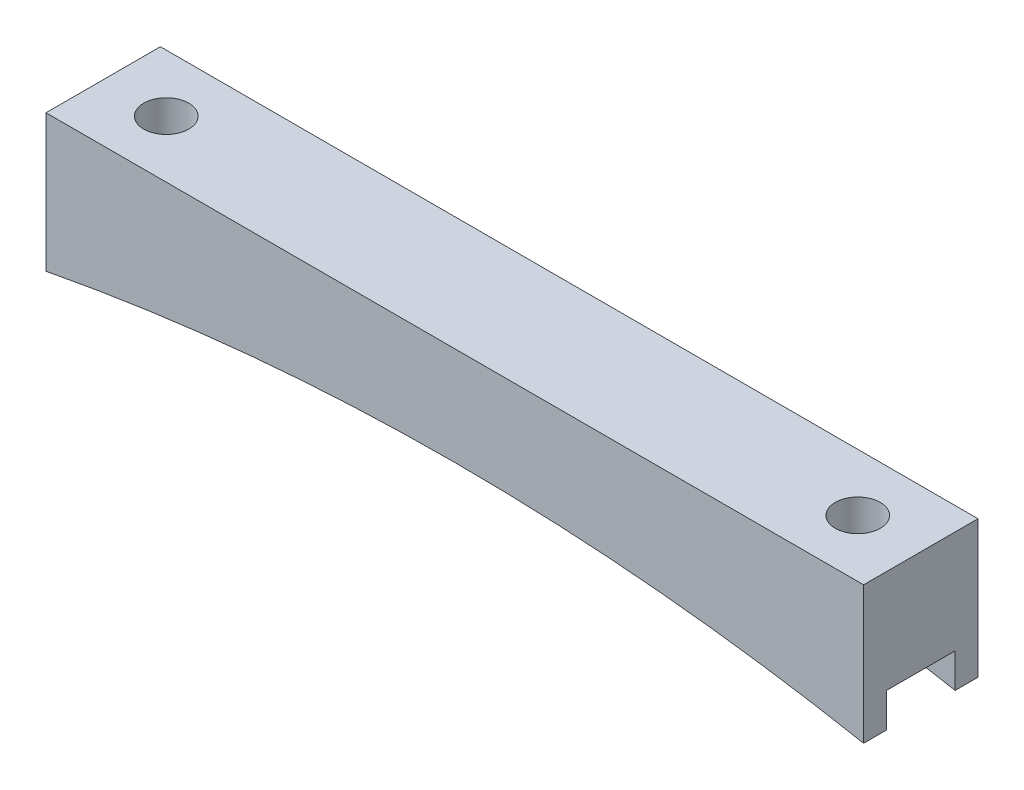
ISO-10303-21;
HEADER;
FILE_DESCRIPTION(('STEP AP214'),'2;1');
FILE_NAME('part.step','',(''),(''),'','','');
FILE_SCHEMA(('AUTOMOTIVE_DESIGN { 1 0 10303 214 1 1 1 1 }'));
ENDSEC;
DATA;
#1=APPLICATION_CONTEXT('core data for automotive mechanical design processes');
#2=APPLICATION_PROTOCOL_DEFINITION('international standard','automotive_design',2000,#1);
#3=PRODUCT_CONTEXT('',#1,'mechanical');
#4=PRODUCT('Part','Part','',(#3));
#5=PRODUCT_RELATED_PRODUCT_CATEGORY('part','',(#4));
#6=PRODUCT_DEFINITION_FORMATION('','',#4);
#7=PRODUCT_DEFINITION_CONTEXT('part definition',#1,'design');
#8=PRODUCT_DEFINITION('design','',#6,#7);
#9=PRODUCT_DEFINITION_SHAPE('','',#8);
#10=(LENGTH_UNIT() NAMED_UNIT(*) SI_UNIT(.MILLI.,.METRE.));
#11=(NAMED_UNIT(*) PLANE_ANGLE_UNIT() SI_UNIT($,.RADIAN.));
#12=(NAMED_UNIT(*) SI_UNIT($,.STERADIAN.) SOLID_ANGLE_UNIT());
#13=UNCERTAINTY_MEASURE_WITH_UNIT(LENGTH_MEASURE(1.E-05),#10,'distance_accuracy_value','');
#14=(GEOMETRIC_REPRESENTATION_CONTEXT(3) GLOBAL_UNCERTAINTY_ASSIGNED_CONTEXT((#13)) GLOBAL_UNIT_ASSIGNED_CONTEXT((#10,
#11,#12)) REPRESENTATION_CONTEXT('',''));
#15=CARTESIAN_POINT('',(0.,0.,0.));
#16=DIRECTION('',(0.,0.,1.));
#17=DIRECTION('',(1.,0.,0.));
#18=AXIS2_PLACEMENT_3D('',#15,#16,#17);
#19=CARTESIAN_POINT('',(45.385,0.,12.7));
#20=DIRECTION('',(-1.,0.,0.));
#21=DIRECTION('',(0.,0.,1.));
#22=AXIS2_PLACEMENT_3D('',#19,#20,#21);
#23=PLANE('',#22);
#24=DIRECTION('',(0.,0.,-1.));
#25=VECTOR('',#24,1.);
#26=CARTESIAN_POINT('',(45.385,-15.24,12.7));
#27=LINE('',#26,#25);
#28=CARTESIAN_POINT('',(45.385,-15.24,12.7));
#29=VERTEX_POINT('',#28);
#30=CARTESIAN_POINT('',(45.385,-15.24,10.16));
#31=VERTEX_POINT('',#30);
#32=EDGE_CURVE('E156',#29,#31,#27,.T.);
#33=ORIENTED_EDGE('',*,*,#32,.T.);
#34=DIRECTION('',(0.,-1.,0.));
#35=VECTOR('',#34,1.);
#36=CARTESIAN_POINT('',(45.385,-15.24,10.16));
#37=LINE('',#36,#35);
#38=CARTESIAN_POINT('',(45.385,-11.43,10.16));
#39=VERTEX_POINT('',#38);
#40=EDGE_CURVE('E185',#39,#31,#37,.T.);
#41=ORIENTED_EDGE('',*,*,#40,.F.);
#42=DIRECTION('',(0.,0.,1.));
#43=VECTOR('',#42,1.);
#44=CARTESIAN_POINT('',(45.385,-11.43,10.16));
#45=LINE('',#44,#43);
#46=CARTESIAN_POINT('',(45.385,-11.43,2.54));
#47=VERTEX_POINT('',#46);
#48=EDGE_CURVE('E141',#47,#39,#45,.T.);
#49=ORIENTED_EDGE('',*,*,#48,.F.);
#50=DIRECTION('',(0.,1.,0.));
#51=VECTOR('',#50,1.);
#52=CARTESIAN_POINT('',(45.385,-15.24,2.54));
#53=LINE('',#52,#51);
#54=CARTESIAN_POINT('',(45.385,-15.24,2.54));
#55=VERTEX_POINT('',#54);
#56=EDGE_CURVE('E177',#55,#47,#53,.T.);
#57=ORIENTED_EDGE('',*,*,#56,.F.);
#58=CARTESIAN_POINT('',(45.385,-15.24,0.));
#59=VERTEX_POINT('',#58);
#60=EDGE_CURVE('E174',#55,#59,#27,.T.);
#61=ORIENTED_EDGE('',*,*,#60,.T.);
#62=DIRECTION('',(0.,1.,0.));
#63=VECTOR('',#62,1.);
#64=CARTESIAN_POINT('',(45.385,0.,0.));
#65=LINE('',#64,#63);
#66=CARTESIAN_POINT('',(45.385,0.,0.));
#67=VERTEX_POINT('',#66);
#68=EDGE_CURVE('E213',#59,#67,#65,.T.);
#69=ORIENTED_EDGE('',*,*,#68,.T.);
#70=DIRECTION('',(0.,0.,-1.));
#71=VECTOR('',#70,1.);
#72=CARTESIAN_POINT('',(45.385,0.,12.7));
#73=LINE('',#72,#71);
#74=CARTESIAN_POINT('',(45.385,0.,12.7));
#75=VERTEX_POINT('',#74);
#76=EDGE_CURVE('E154',#75,#67,#73,.T.);
#77=ORIENTED_EDGE('',*,*,#76,.F.);
#78=DIRECTION('',(0.,1.,0.));
#79=VECTOR('',#78,1.);
#80=CARTESIAN_POINT('',(45.385,0.,12.7));
#81=LINE('',#80,#79);
#82=EDGE_CURVE('E217',#29,#75,#81,.T.);
#83=ORIENTED_EDGE('',*,*,#82,.F.);
#84=EDGE_LOOP('',(#33,#41,#49,#57,#61,#69,#77,#83));
#85=FACE_BOUND('',#84,.T.);
#86=ADVANCED_FACE('F43',(#85),#23,.F.);
#87=CARTESIAN_POINT('',(-45.385,0.,12.7));
#88=DIRECTION('',(0.,-1.,0.));
#89=DIRECTION('',(1.,0.,0.));
#90=AXIS2_PLACEMENT_3D('',#87,#88,#89);
#91=PLANE('',#90);
#92=CARTESIAN_POINT('',(-38.385,0.,6.35));
#93=DIRECTION('',(0.,1.,0.));
#94=DIRECTION('',(-1.,0.,0.));
#95=AXIS2_PLACEMENT_3D('',#92,#93,#94);
#96=CIRCLE('',#95,2.49999999999999);
#97=CARTESIAN_POINT('',(-40.885,0.,6.35));
#98=VERTEX_POINT('',#97);
#99=EDGE_CURVE('E209',#98,#98,#96,.T.);
#100=ORIENTED_EDGE('',*,*,#99,.F.);
#101=EDGE_LOOP('',(#100));
#102=FACE_BOUND('',#101,.T.);
#103=CARTESIAN_POINT('',(38.385,0.,6.35));
#104=DIRECTION('',(0.,1.,0.));
#105=DIRECTION('',(-1.,0.,0.));
#106=AXIS2_PLACEMENT_3D('',#103,#104,#105);
#107=CIRCLE('',#106,2.5);
#108=CARTESIAN_POINT('',(35.885,0.,6.35));
#109=VERTEX_POINT('',#108);
#110=EDGE_CURVE('E208',#109,#109,#107,.T.);
#111=ORIENTED_EDGE('',*,*,#110,.F.);
#112=EDGE_LOOP('',(#111));
#113=FACE_BOUND('',#112,.T.);
#114=DIRECTION('',(-1.,0.,0.));
#115=VECTOR('',#114,1.);
#116=CARTESIAN_POINT('',(-45.385,0.,0.));
#117=LINE('',#116,#115);
#118=CARTESIAN_POINT('',(-45.385,0.,0.));
#119=VERTEX_POINT('',#118);
#120=EDGE_CURVE('E232',#67,#119,#117,.T.);
#121=ORIENTED_EDGE('',*,*,#120,.T.);
#122=DIRECTION('',(0.,0.,-1.));
#123=VECTOR('',#122,1.);
#124=CARTESIAN_POINT('',(-45.385,0.,12.7));
#125=LINE('',#124,#123);
#126=CARTESIAN_POINT('',(-45.385,0.,12.7));
#127=VERTEX_POINT('',#126);
#128=EDGE_CURVE('E148',#127,#119,#125,.T.);
#129=ORIENTED_EDGE('',*,*,#128,.F.);
#130=DIRECTION('',(-1.,0.,0.));
#131=VECTOR('',#130,1.);
#132=CARTESIAN_POINT('',(-45.385,0.,12.7));
#133=LINE('',#132,#131);
#134=EDGE_CURVE('E221',#75,#127,#133,.T.);
#135=ORIENTED_EDGE('',*,*,#134,.F.);
#136=ORIENTED_EDGE('',*,*,#76,.T.);
#137=EDGE_LOOP('',(#121,#129,#135,#136));
#138=FACE_BOUND('',#137,.T.);
#139=ADVANCED_FACE('F247',(#102,#113,#138),#91,.F.);
#140=CARTESIAN_POINT('',(-45.385,0.,12.7));
#141=DIRECTION('',(1.,0.,0.));
#142=DIRECTION('',(0.,0.,-1.));
#143=AXIS2_PLACEMENT_3D('',#140,#141,#142);
#144=PLANE('',#143);
#145=DIRECTION('',(0.,0.,1.));
#146=VECTOR('',#145,1.);
#147=CARTESIAN_POINT('',(-45.385,-11.43,10.16));
#148=LINE('',#147,#146);
#149=CARTESIAN_POINT('',(-45.385,-11.43,2.54));
#150=VERTEX_POINT('',#149);
#151=CARTESIAN_POINT('',(-45.385,-11.43,10.16));
#152=VERTEX_POINT('',#151);
#153=EDGE_CURVE('E139',#150,#152,#148,.T.);
#154=ORIENTED_EDGE('',*,*,#153,.T.);
#155=DIRECTION('',(0.,-1.,0.));
#156=VECTOR('',#155,1.);
#157=CARTESIAN_POINT('',(-45.385,-15.24,10.16));
#158=LINE('',#157,#156);
#159=CARTESIAN_POINT('',(-45.385,-15.24,10.16));
#160=VERTEX_POINT('',#159);
#161=EDGE_CURVE('E124',#152,#160,#158,.T.);
#162=ORIENTED_EDGE('',*,*,#161,.T.);
#163=DIRECTION('',(0.,0.,-1.));
#164=VECTOR('',#163,1.);
#165=CARTESIAN_POINT('',(-45.385,-15.24,12.7));
#166=LINE('',#165,#164);
#167=CARTESIAN_POINT('',(-45.385,-15.24,12.7));
#168=VERTEX_POINT('',#167);
#169=EDGE_CURVE('E136',#168,#160,#166,.T.);
#170=ORIENTED_EDGE('',*,*,#169,.F.);
#171=DIRECTION('',(0.,-1.,0.));
#172=VECTOR('',#171,1.);
#173=CARTESIAN_POINT('',(-45.385,0.,12.7));
#174=LINE('',#173,#172);
#175=EDGE_CURVE('E225',#127,#168,#174,.T.);
#176=ORIENTED_EDGE('',*,*,#175,.F.);
#177=ORIENTED_EDGE('',*,*,#128,.T.);
#178=DIRECTION('',(0.,-1.,0.));
#179=VECTOR('',#178,1.);
#180=CARTESIAN_POINT('',(-45.385,0.,0.));
#181=LINE('',#180,#179);
#182=CARTESIAN_POINT('',(-45.385,-15.24,0.));
#183=VERTEX_POINT('',#182);
#184=EDGE_CURVE('E235',#119,#183,#181,.T.);
#185=ORIENTED_EDGE('',*,*,#184,.T.);
#186=CARTESIAN_POINT('',(-45.385,-15.24,2.54));
#187=VERTEX_POINT('',#186);
#188=EDGE_CURVE('E149',#187,#183,#166,.T.);
#189=ORIENTED_EDGE('',*,*,#188,.F.);
#190=DIRECTION('',(0.,1.,0.));
#191=VECTOR('',#190,1.);
#192=CARTESIAN_POINT('',(-45.385,-15.24,2.54));
#193=LINE('',#192,#191);
#194=EDGE_CURVE('E67',#187,#150,#193,.T.);
#195=ORIENTED_EDGE('',*,*,#194,.T.);
#196=EDGE_LOOP('',(#154,#162,#170,#176,#177,#185,#189,#195));
#197=FACE_BOUND('',#196,.T.);
#198=ADVANCED_FACE('F134',(#197),#144,.F.);
#199=CARTESIAN_POINT('',(0.,-252.233442472571,12.7));
#200=DIRECTION('',(0.,0.,-1.));
#201=DIRECTION('',(-1.,0.,0.));
#202=AXIS2_PLACEMENT_3D('',#199,#200,#201);
#203=CYLINDRICAL_SURFACE('',#202,241.3);
#204=DIRECTION('',(0.,0.,-1.));
#205=VECTOR('',#204,1.);
#206=CARTESIAN_POINT('',(15.4723008424407,-11.43,12.7));
#207=LINE('',#206,#205);
#208=CARTESIAN_POINT('',(15.4723008424407,-11.43,2.54));
#209=VERTEX_POINT('',#208);
#210=CARTESIAN_POINT('',(15.4723008424407,-11.43,10.16));
#211=VERTEX_POINT('',#210);
#212=EDGE_CURVE('E172',#209,#211,#207,.F.);
#213=ORIENTED_EDGE('',*,*,#212,.T.);
#214=CARTESIAN_POINT('',(0.,-252.233442472571,10.16));
#215=DIRECTION('',(0.,0.,1.));
#216=DIRECTION('',(1.,0.,0.));
#217=AXIS2_PLACEMENT_3D('',#214,#215,#216);
#218=CIRCLE('',#217,241.3);
#219=EDGE_CURVE('E11',#211,#31,#218,.F.);
#220=ORIENTED_EDGE('',*,*,#219,.T.);
#221=ORIENTED_EDGE('',*,*,#32,.F.);
#222=CARTESIAN_POINT('',(0.,-252.233442472571,12.7));
#223=DIRECTION('',(0.,0.,-1.));
#224=DIRECTION('',(-1.,0.,0.));
#225=AXIS2_PLACEMENT_3D('',#222,#223,#224);
#226=CIRCLE('',#225,241.3);
#227=EDGE_CURVE('E146',#168,#29,#226,.T.);
#228=ORIENTED_EDGE('',*,*,#227,.F.);
#229=ORIENTED_EDGE('',*,*,#169,.T.);
#230=CARTESIAN_POINT('',(-15.4723008424407,-11.43,10.16));
#231=VERTEX_POINT('',#230);
#232=EDGE_CURVE('E46',#160,#231,#218,.F.);
#233=ORIENTED_EDGE('',*,*,#232,.T.);
#234=DIRECTION('',(0.,0.,-1.));
#235=VECTOR('',#234,1.);
#236=CARTESIAN_POINT('',(-15.4723008424407,-11.43,12.7));
#237=LINE('',#236,#235);
#238=CARTESIAN_POINT('',(-15.4723008424407,-11.43,2.54));
#239=VERTEX_POINT('',#238);
#240=EDGE_CURVE('E203',#231,#239,#237,.T.);
#241=ORIENTED_EDGE('',*,*,#240,.T.);
#242=CARTESIAN_POINT('',(0.,-252.233442472571,2.54));
#243=DIRECTION('',(0.,0.,-1.));
#244=DIRECTION('',(-1.,0.,0.));
#245=AXIS2_PLACEMENT_3D('',#242,#243,#244);
#246=CIRCLE('',#245,241.3);
#247=EDGE_CURVE('E131',#239,#187,#246,.F.);
#248=ORIENTED_EDGE('',*,*,#247,.T.);
#249=ORIENTED_EDGE('',*,*,#188,.T.);
#250=CARTESIAN_POINT('',(0.,-252.233442472571,0.));
#251=DIRECTION('',(0.,0.,-1.));
#252=DIRECTION('',(-1.,0.,0.));
#253=AXIS2_PLACEMENT_3D('',#250,#251,#252);
#254=CIRCLE('',#253,241.3);
#255=EDGE_CURVE('E222',#183,#59,#254,.T.);
#256=ORIENTED_EDGE('',*,*,#255,.T.);
#257=ORIENTED_EDGE('',*,*,#60,.F.);
#258=EDGE_CURVE('E52',#55,#209,#246,.F.);
#259=ORIENTED_EDGE('',*,*,#258,.T.);
#260=EDGE_LOOP('',(#213,#220,#221,#228,#229,#233,#241,#248,#249,#256,#257,#259));
#261=FACE_BOUND('',#260,.T.);
#262=ADVANCED_FACE('F144',(#261),#203,.F.);
#263=CARTESIAN_POINT('',(0.,-252.233442472571,12.7));
#264=DIRECTION('',(0.,0.,-1.));
#265=DIRECTION('',(-1.,0.,0.));
#266=AXIS2_PLACEMENT_3D('',#263,#264,#265);
#267=PLANE('',#266);
#268=ORIENTED_EDGE('',*,*,#82,.T.);
#269=ORIENTED_EDGE('',*,*,#134,.T.);
#270=ORIENTED_EDGE('',*,*,#175,.T.);
#271=ORIENTED_EDGE('',*,*,#227,.T.);
#272=EDGE_LOOP('',(#268,#269,#270,#271));
#273=FACE_BOUND('',#272,.T.);
#274=ADVANCED_FACE('F250',(#273),#267,.F.);
#275=CARTESIAN_POINT('',(0.,-252.233442472571,0.));
#276=DIRECTION('',(0.,0.,-1.));
#277=DIRECTION('',(-1.,0.,0.));
#278=AXIS2_PLACEMENT_3D('',#275,#276,#277);
#279=PLANE('',#278);
#280=ORIENTED_EDGE('',*,*,#68,.F.);
#281=ORIENTED_EDGE('',*,*,#255,.F.);
#282=ORIENTED_EDGE('',*,*,#184,.F.);
#283=ORIENTED_EDGE('',*,*,#120,.F.);
#284=EDGE_LOOP('',(#280,#281,#282,#283));
#285=FACE_BOUND('',#284,.T.);
#286=ADVANCED_FACE('F243',(#285),#279,.T.);
#287=CARTESIAN_POINT('',(38.385,-15.24,6.35));
#288=DIRECTION('',(0.,1.,0.));
#289=DIRECTION('',(-1.,0.,0.));
#290=AXIS2_PLACEMENT_3D('',#287,#288,#289);
#291=CYLINDRICAL_SURFACE('',#290,2.5);
#292=CARTESIAN_POINT('',(38.385,-11.43,6.35));
#293=DIRECTION('',(0.,1.,0.));
#294=DIRECTION('',(0.,0.,1.));
#295=AXIS2_PLACEMENT_3D('',#292,#293,#294);
#296=CIRCLE('',#295,2.5);
#297=CARTESIAN_POINT('',(38.385,-11.43,8.85));
#298=VERTEX_POINT('',#297);
#299=EDGE_CURVE('E166',#298,#298,#296,.F.);
#300=ORIENTED_EDGE('',*,*,#299,.T.);
#301=EDGE_LOOP('',(#300));
#302=FACE_BOUND('',#301,.T.);
#303=ORIENTED_EDGE('',*,*,#110,.T.);
#304=EDGE_LOOP('',(#303));
#305=FACE_BOUND('',#304,.T.);
#306=ADVANCED_FACE('F292',(#302,#305),#291,.F.);
#307=CARTESIAN_POINT('',(-38.385,-15.24,6.35));
#308=DIRECTION('',(0.,1.,0.));
#309=DIRECTION('',(-1.,0.,0.));
#310=AXIS2_PLACEMENT_3D('',#307,#308,#309);
#311=CYLINDRICAL_SURFACE('',#310,2.49999999999999);
#312=CARTESIAN_POINT('',(-38.385,-11.43,6.35));
#313=DIRECTION('',(0.,1.,0.));
#314=DIRECTION('',(0.,0.,1.));
#315=AXIS2_PLACEMENT_3D('',#312,#313,#314);
#316=CIRCLE('',#315,2.49999999999999);
#317=CARTESIAN_POINT('',(-38.385,-11.43,8.84999999999999));
#318=VERTEX_POINT('',#317);
#319=EDGE_CURVE('E163',#318,#318,#316,.F.);
#320=ORIENTED_EDGE('',*,*,#319,.T.);
#321=EDGE_LOOP('',(#320));
#322=FACE_BOUND('',#321,.T.);
#323=ORIENTED_EDGE('',*,*,#99,.T.);
#324=EDGE_LOOP('',(#323));
#325=FACE_BOUND('',#324,.T.);
#326=ADVANCED_FACE('F274',(#322,#325),#311,.F.);
#327=CARTESIAN_POINT('',(-45.385,-11.43,10.16));
#328=DIRECTION('',(0.,1.,0.));
#329=DIRECTION('',(0.,0.,1.));
#330=AXIS2_PLACEMENT_3D('',#327,#328,#329);
#331=PLANE('',#330);
#332=ORIENTED_EDGE('',*,*,#319,.F.);
#333=EDGE_LOOP('',(#332));
#334=FACE_BOUND('',#333,.T.);
#335=DIRECTION('',(1.,0.,0.));
#336=VECTOR('',#335,1.);
#337=CARTESIAN_POINT('',(-45.385,-11.43,10.16));
#338=LINE('',#337,#336);
#339=EDGE_CURVE('E126',#152,#231,#338,.T.);
#340=ORIENTED_EDGE('',*,*,#339,.F.);
#341=ORIENTED_EDGE('',*,*,#153,.F.);
#342=DIRECTION('',(1.,0.,0.));
#343=VECTOR('',#342,1.);
#344=CARTESIAN_POINT('',(-45.385,-11.43,2.54));
#345=LINE('',#344,#343);
#346=EDGE_CURVE('E196',#150,#239,#345,.T.);
#347=ORIENTED_EDGE('',*,*,#346,.T.);
#348=ORIENTED_EDGE('',*,*,#240,.F.);
#349=EDGE_LOOP('',(#340,#341,#347,#348));
#350=FACE_BOUND('',#349,.T.);
#351=ADVANCED_FACE('F266',(#334,#350),#331,.F.);
#352=CARTESIAN_POINT('',(-45.385,-15.24,2.54));
#353=DIRECTION('',(0.,0.,-1.));
#354=DIRECTION('',(-1.,0.,0.));
#355=AXIS2_PLACEMENT_3D('',#352,#353,#354);
#356=PLANE('',#355);
#357=ORIENTED_EDGE('',*,*,#346,.F.);
#358=ORIENTED_EDGE('',*,*,#194,.F.);
#359=ORIENTED_EDGE('',*,*,#247,.F.);
#360=EDGE_LOOP('',(#357,#358,#359));
#361=FACE_BOUND('',#360,.T.);
#362=ADVANCED_FACE('F271',(#361),#356,.F.);
#363=CARTESIAN_POINT('',(-45.385,-15.24,10.16));
#364=DIRECTION('',(0.,0.,1.));
#365=DIRECTION('',(1.,0.,0.));
#366=AXIS2_PLACEMENT_3D('',#363,#364,#365);
#367=PLANE('',#366);
#368=ORIENTED_EDGE('',*,*,#161,.F.);
#369=ORIENTED_EDGE('',*,*,#339,.T.);
#370=ORIENTED_EDGE('',*,*,#232,.F.);
#371=EDGE_LOOP('',(#368,#369,#370));
#372=FACE_BOUND('',#371,.T.);
#373=ADVANCED_FACE('F123',(#372),#367,.F.);
#374=EDGE_CURVE('E195',#211,#39,#338,.T.);
#375=ORIENTED_EDGE('',*,*,#374,.T.);
#376=ORIENTED_EDGE('',*,*,#40,.T.);
#377=ORIENTED_EDGE('',*,*,#219,.F.);
#378=EDGE_LOOP('',(#375,#376,#377));
#379=FACE_BOUND('',#378,.T.);
#380=ADVANCED_FACE('F254',(#379),#367,.F.);
#381=ORIENTED_EDGE('',*,*,#56,.T.);
#382=EDGE_CURVE('E59',#209,#47,#345,.T.);
#383=ORIENTED_EDGE('',*,*,#382,.F.);
#384=ORIENTED_EDGE('',*,*,#258,.F.);
#385=EDGE_LOOP('',(#381,#383,#384));
#386=FACE_BOUND('',#385,.T.);
#387=ADVANCED_FACE('F176',(#386),#356,.F.);
#388=ORIENTED_EDGE('',*,*,#299,.F.);
#389=EDGE_LOOP('',(#388));
#390=FACE_BOUND('',#389,.T.);
#391=ORIENTED_EDGE('',*,*,#382,.T.);
#392=ORIENTED_EDGE('',*,*,#48,.T.);
#393=ORIENTED_EDGE('',*,*,#374,.F.);
#394=ORIENTED_EDGE('',*,*,#212,.F.);
#395=EDGE_LOOP('',(#391,#392,#393,#394));
#396=FACE_BOUND('',#395,.T.);
#397=ADVANCED_FACE('F258',(#390,#396),#331,.F.);
#398=CLOSED_SHELL('',(#86,#139,#198,#262,#274,#286,#306,#326,#351,#362,#373,#380,#387,#397));
#399=MANIFOLD_SOLID_BREP('B2',#398);
#400=ADVANCED_BREP_SHAPE_REPRESENTATION('',(#18,#399),#14);
#401=SHAPE_DEFINITION_REPRESENTATION(#9,#400);
ENDSEC;
END-ISO-10303-21;
